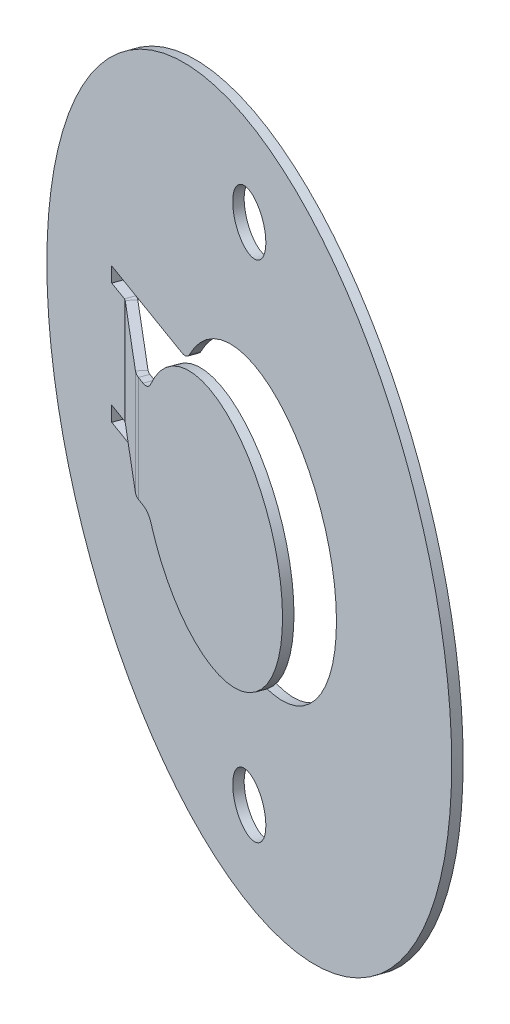
ISO-10303-21;
HEADER;
FILE_DESCRIPTION(('STEP AP214'),'2;1');
FILE_NAME('part.step','',(''),(''),'','','');
FILE_SCHEMA(('AUTOMOTIVE_DESIGN { 1 0 10303 214 1 1 1 1 }'));
ENDSEC;
DATA;
#1=APPLICATION_CONTEXT('core data for automotive mechanical design processes');
#2=APPLICATION_PROTOCOL_DEFINITION('international standard','automotive_design',2000,#1);
#3=PRODUCT_CONTEXT('',#1,'mechanical');
#4=PRODUCT('Part','Part','',(#3));
#5=PRODUCT_RELATED_PRODUCT_CATEGORY('part','',(#4));
#6=PRODUCT_DEFINITION_FORMATION('','',#4);
#7=PRODUCT_DEFINITION_CONTEXT('part definition',#1,'design');
#8=PRODUCT_DEFINITION('design','',#6,#7);
#9=PRODUCT_DEFINITION_SHAPE('','',#8);
#10=(LENGTH_UNIT() NAMED_UNIT(*) SI_UNIT(.MILLI.,.METRE.));
#11=(NAMED_UNIT(*) PLANE_ANGLE_UNIT() SI_UNIT($,.RADIAN.));
#12=(NAMED_UNIT(*) SI_UNIT($,.STERADIAN.) SOLID_ANGLE_UNIT());
#13=UNCERTAINTY_MEASURE_WITH_UNIT(LENGTH_MEASURE(1.E-05),#10,'distance_accuracy_value','');
#14=(GEOMETRIC_REPRESENTATION_CONTEXT(3) GLOBAL_UNCERTAINTY_ASSIGNED_CONTEXT((#13)) GLOBAL_UNIT_ASSIGNED_CONTEXT((#10,
#11,#12)) REPRESENTATION_CONTEXT('',''));
#15=CARTESIAN_POINT('',(0.,0.,0.));
#16=DIRECTION('',(0.,0.,1.));
#17=DIRECTION('',(1.,0.,0.));
#18=AXIS2_PLACEMENT_3D('',#15,#16,#17);
#19=CARTESIAN_POINT('',(-7.10565534939488,-1.8,-1.16279994263227));
#20=DIRECTION('',(0.,1.,0.));
#21=DIRECTION('',(-0.763796028634641,0.,-0.645457687723952));
#22=AXIS2_PLACEMENT_3D('',#19,#20,#21);
#23=PLANE('',#22);
#24=DIRECTION('',(0.763796028634641,0.,0.645457687723952));
#25=VECTOR('',#24,1.);
#26=CARTESIAN_POINT('',(-1.00787474173192,-1.8,3.59744917488349));
#27=LINE('',#26,#25);
#28=CARTESIAN_POINT('',(-4.05131456306547,-1.8,1.02554312122604));
#29=VERTEX_POINT('',#28);
#30=CARTESIAN_POINT('',(-6.27169304111087,-1.8,-0.850822170791939));
#31=VERTEX_POINT('',#30);
#32=EDGE_CURVE('E70',#29,#31,#27,.F.);
#33=ORIENTED_EDGE('',*,*,#32,.F.);
#34=DIRECTION('',(-0.645457687723952,0.,0.763796028634641));
#35=VECTOR('',#34,1.);
#36=CARTESIAN_POINT('',(-4.24495186938265,-1.8,1.25468192981643));
#37=LINE('',#36,#35);
#38=CARTESIAN_POINT('',(-4.24495186938265,-1.8,1.25468192981643));
#39=VERTEX_POINT('',#38);
#40=EDGE_CURVE('E194',#29,#39,#37,.T.);
#41=ORIENTED_EDGE('',*,*,#40,.T.);
#42=DIRECTION('',(-0.763796028634641,0.,-0.645457687723952));
#43=VECTOR('',#42,1.);
#44=CARTESIAN_POINT('',(-7.10565534939488,-1.8,-1.16279994263227));
#45=LINE('',#44,#43);
#46=CARTESIAN_POINT('',(-6.46533034742805,-1.8,-0.621683362201546));
#47=VERTEX_POINT('',#46);
#48=EDGE_CURVE('E49',#39,#47,#45,.T.);
#49=ORIENTED_EDGE('',*,*,#48,.T.);
#50=DIRECTION('',(-0.645457687723952,0.,0.763796028634641));
#51=VECTOR('',#50,1.);
#52=CARTESIAN_POINT('',(-6.46533034742805,-1.8,-0.621683362201546));
#53=LINE('',#52,#51);
#54=EDGE_CURVE('E195',#31,#47,#53,.T.);
#55=ORIENTED_EDGE('',*,*,#54,.F.);
#56=EDGE_LOOP('',(#33,#41,#49,#55));
#57=FACE_BOUND('',#56,.T.);
#58=ADVANCED_FACE('F45',(#57),#23,.F.);
#59=CARTESIAN_POINT('',(-3.87259407507794,1.75,1.56934866269738));
#60=DIRECTION('',(0.,-1.,0.));
#61=DIRECTION('',(0.763796028634641,0.,0.645457687723952));
#62=AXIS2_PLACEMENT_3D('',#59,#60,#61);
#63=PLANE('',#62);
#64=DIRECTION('',(0.763796028634641,0.,0.645457687723952));
#65=VECTOR('',#64,1.);
#66=CARTESIAN_POINT('',(-3.87259407507794,1.75,1.56934866269738));
#67=LINE('',#66,#65);
#68=CARTESIAN_POINT('',(-6.46533034742805,1.75,-0.621683362201546));
#69=VERTEX_POINT('',#68);
#70=CARTESIAN_POINT('',(-4.24495186938265,1.75,1.25468192981643));
#71=VERTEX_POINT('',#70);
#72=EDGE_CURVE('E213',#69,#71,#67,.T.);
#73=ORIENTED_EDGE('',*,*,#72,.T.);
#74=DIRECTION('',(0.645457687723952,0.,-0.763796028634641));
#75=VECTOR('',#74,1.);
#76=CARTESIAN_POINT('',(-4.24495186938265,1.75,1.25468192981643));
#77=LINE('',#76,#75);
#78=CARTESIAN_POINT('',(-4.05131456306547,1.75,1.02554312122604));
#79=VERTEX_POINT('',#78);
#80=EDGE_CURVE('E12',#71,#79,#77,.T.);
#81=ORIENTED_EDGE('',*,*,#80,.T.);
#82=DIRECTION('',(0.763796028634641,0.,0.645457687723952));
#83=VECTOR('',#82,1.);
#84=CARTESIAN_POINT('',(-1.00787474173192,1.75,3.59744917488349));
#85=LINE('',#84,#83);
#86=CARTESIAN_POINT('',(-6.27169304111087,1.75,-0.850822170791939));
#87=VERTEX_POINT('',#86);
#88=EDGE_CURVE('E219',#87,#79,#85,.T.);
#89=ORIENTED_EDGE('',*,*,#88,.F.);
#90=DIRECTION('',(0.645457687723952,0.,-0.763796028634641));
#91=VECTOR('',#90,1.);
#92=CARTESIAN_POINT('',(-6.46533034742805,1.75,-0.621683362201546));
#93=LINE('',#92,#91);
#94=EDGE_CURVE('E329',#69,#87,#93,.T.);
#95=ORIENTED_EDGE('',*,*,#94,.F.);
#96=EDGE_LOOP('',(#73,#81,#89,#95));
#97=FACE_BOUND('',#96,.T.);
#98=ADVANCED_FACE('F47',(#97),#63,.F.);
#99=CARTESIAN_POINT('',(-1.2015120480491,0.,3.82658798347388));
#100=DIRECTION('',(-0.645457687723952,0.,0.763796028634641));
#101=DIRECTION('',(0.763796028634641,0.,0.645457687723952));
#102=AXIS2_PLACEMENT_3D('',#99,#100,#101);
#103=PLANE('',#102);
#104=ORIENTED_EDGE('',*,*,#48,.F.);
#105=DIRECTION('',(0.,1.,0.));
#106=VECTOR('',#105,1.);
#107=CARTESIAN_POINT('',(-4.24495186938265,0.,1.25468192981643));
#108=LINE('',#107,#106);
#109=EDGE_CURVE('E186',#39,#71,#108,.T.);
#110=ORIENTED_EDGE('',*,*,#109,.T.);
#111=ORIENTED_EDGE('',*,*,#72,.F.);
#112=DIRECTION('',(0.,1.,0.));
#113=VECTOR('',#112,1.);
#114=CARTESIAN_POINT('',(-6.46533034742805,0.,-0.621683362201546));
#115=LINE('',#114,#113);
#116=EDGE_CURVE('E210',#47,#69,#115,.T.);
#117=ORIENTED_EDGE('',*,*,#116,.F.);
#118=EDGE_LOOP('',(#104,#110,#111,#117));
#119=FACE_BOUND('',#118,.T.);
#120=ADVANCED_FACE('F208',(#119),#103,.T.);
#121=CARTESIAN_POINT('',(-1.00787474173192,0.,3.59744917488349));
#122=DIRECTION('',(-0.645457687723952,0.,0.763796028634641));
#123=DIRECTION('',(0.763796028634641,0.,0.645457687723952));
#124=AXIS2_PLACEMENT_3D('',#121,#122,#123);
#125=PLANE('',#124);
#126=DIRECTION('',(0.,1.,0.));
#127=VECTOR('',#126,1.);
#128=CARTESIAN_POINT('',(-4.05131456306547,0.,1.02554312122604));
#129=LINE('',#128,#127);
#130=EDGE_CURVE('E54',#29,#79,#129,.T.);
#131=ORIENTED_EDGE('',*,*,#130,.F.);
#132=ORIENTED_EDGE('',*,*,#32,.T.);
#133=DIRECTION('',(0.,1.,0.));
#134=VECTOR('',#133,1.);
#135=CARTESIAN_POINT('',(-6.27169304111087,0.,-0.850822170791939));
#136=LINE('',#135,#134);
#137=EDGE_CURVE('E332',#31,#87,#136,.T.);
#138=ORIENTED_EDGE('',*,*,#137,.T.);
#139=ORIENTED_EDGE('',*,*,#88,.T.);
#140=EDGE_LOOP('',(#131,#132,#138,#139));
#141=FACE_BOUND('',#140,.T.);
#142=ADVANCED_FACE('F407',(#141),#125,.F.);
#143=CARTESIAN_POINT('',(-7.19785182118393,-1.8,-0.90139024621579));
#144=DIRECTION('',(-0.939692620785908,0.,-0.342020143325669));
#145=DIRECTION('',(0.,-1.,0.));
#146=AXIS2_PLACEMENT_3D('',#143,#144,#145);
#147=PLANE('',#146);
#148=DIRECTION('',(-0.342020143325669,0.,0.939692620785908));
#149=VECTOR('',#148,1.);
#150=CARTESIAN_POINT('',(-7.19785182118393,-2.3,-0.90139024621579));
#151=LINE('',#150,#149);
#152=CARTESIAN_POINT('',(-7.09524577818623,-2.3,-1.18329803245156));
#153=VERTEX_POINT('',#152);
#154=CARTESIAN_POINT('',(-7.19785182118393,-2.3,-0.90139024621579));
#155=VERTEX_POINT('',#154);
#156=EDGE_CURVE('E317',#153,#155,#151,.T.);
#157=ORIENTED_EDGE('',*,*,#156,.F.);
#158=DIRECTION('',(0.,1.,0.));
#159=VECTOR('',#158,1.);
#160=CARTESIAN_POINT('',(-7.09524577818623,0.,-1.18329803245156));
#161=LINE('',#160,#159);
#162=CARTESIAN_POINT('',(-7.09524577818623,-1.8,-1.18329803245156));
#163=VERTEX_POINT('',#162);
#164=EDGE_CURVE('E261',#163,#153,#161,.F.);
#165=ORIENTED_EDGE('',*,*,#164,.F.);
#166=DIRECTION('',(-0.342020143325669,0.,0.939692620785908));
#167=VECTOR('',#166,1.);
#168=CARTESIAN_POINT('',(-7.19785182118393,-1.8,-0.90139024621579));
#169=LINE('',#168,#167);
#170=CARTESIAN_POINT('',(-7.19785182118393,-1.8,-0.90139024621579));
#171=VERTEX_POINT('',#170);
#172=EDGE_CURVE('E322',#163,#171,#169,.T.);
#173=ORIENTED_EDGE('',*,*,#172,.T.);
#174=DIRECTION('',(0.,-1.,0.));
#175=VECTOR('',#174,1.);
#176=CARTESIAN_POINT('',(-7.19785182118393,-1.8,-0.90139024621579));
#177=LINE('',#176,#175);
#178=EDGE_CURVE('E319',#171,#155,#177,.T.);
#179=ORIENTED_EDGE('',*,*,#178,.T.);
#180=EDGE_LOOP('',(#157,#165,#173,#179));
#181=FACE_BOUND('',#180,.T.);
#182=ADVANCED_FACE('F409',(#181),#147,.F.);
#183=CARTESIAN_POINT('',(-7.19785182118393,-2.3,-0.90139024621579));
#184=DIRECTION('',(0.,-1.,0.));
#185=DIRECTION('',(0.939692620785908,0.,0.342020143325669));
#186=AXIS2_PLACEMENT_3D('',#183,#184,#185);
#187=PLANE('',#186);
#188=DIRECTION('',(-0.342020143325669,0.,0.939692620785908));
#189=VECTOR('',#188,1.);
#190=CARTESIAN_POINT('',(-3.45079276047736,-2.3,0.462427717918881));
#191=LINE('',#190,#189);
#192=CARTESIAN_POINT('',(-3.34818671747965,-2.3,0.180519931683108));
#193=VERTEX_POINT('',#192);
#194=CARTESIAN_POINT('',(-3.45079276047736,-2.3,0.462427717918881));
#195=VERTEX_POINT('',#194);
#196=EDGE_CURVE('E312',#193,#195,#191,.T.);
#197=ORIENTED_EDGE('',*,*,#196,.F.);
#198=DIRECTION('',(0.939692620785908,0.,0.342020143325669));
#199=VECTOR('',#198,1.);
#200=CARTESIAN_POINT('',(0.168578180488842,-2.3,1.46051767545586));
#201=LINE('',#200,#199);
#202=EDGE_CURVE('E258',#153,#193,#201,.T.);
#203=ORIENTED_EDGE('',*,*,#202,.F.);
#204=ORIENTED_EDGE('',*,*,#156,.T.);
#205=DIRECTION('',(0.939692620785908,0.,0.342020143325669));
#206=VECTOR('',#205,1.);
#207=CARTESIAN_POINT('',(-7.19785182118393,-2.3,-0.90139024621579));
#208=LINE('',#207,#206);
#209=EDGE_CURVE('E314',#155,#195,#208,.T.);
#210=ORIENTED_EDGE('',*,*,#209,.T.);
#211=EDGE_LOOP('',(#197,#203,#204,#210));
#212=FACE_BOUND('',#211,.T.);
#213=ADVANCED_FACE('F414',(#212),#187,.F.);
#214=CARTESIAN_POINT('',(-3.45079276047736,-2.8,0.462427717918881));
#215=DIRECTION('',(-0.342020143325669,0.,0.939692620785908));
#216=DIRECTION('',(0.939692620785908,0.,0.342020143325669));
#217=AXIS2_PLACEMENT_3D('',#214,#215,#216);
#218=CYLINDRICAL_SURFACE('',#217,0.5);
#219=DIRECTION('',(-0.342020143325669,0.,0.939692620785908));
#220=VECTOR('',#219,1.);
#221=CARTESIAN_POINT('',(-3.06152856584907,-2.52,0.604108298029183));
#222=LINE('',#221,#220);
#223=CARTESIAN_POINT('',(-2.95892252285137,-2.52,0.322200511793411));
#224=VERTEX_POINT('',#223);
#225=CARTESIAN_POINT('',(-3.06152856584907,-2.52,0.604108298029183));
#226=VERTEX_POINT('',#225);
#227=EDGE_CURVE('E307',#224,#226,#222,.T.);
#228=ORIENTED_EDGE('',*,*,#227,.F.);
#229=CARTESIAN_POINT('',(-3.34818671747965,-2.8,0.180519931683108));
#230=DIRECTION('',(0.342020143325669,0.,-0.939692620785908));
#231=DIRECTION('',(-0.939692620785908,0.,-0.342020143325669));
#232=AXIS2_PLACEMENT_3D('',#229,#230,#231);
#233=CIRCLE('',#232,0.5);
#234=EDGE_CURVE('E255',#193,#224,#233,.T.);
#235=ORIENTED_EDGE('',*,*,#234,.F.);
#236=ORIENTED_EDGE('',*,*,#196,.T.);
#237=CARTESIAN_POINT('',(-3.45079276047736,-2.8,0.462427717918881));
#238=DIRECTION('',(0.342020143325669,0.,-0.939692620785908));
#239=DIRECTION('',(0.939692620785908,0.,0.342020143325669));
#240=AXIS2_PLACEMENT_3D('',#237,#238,#239);
#241=CIRCLE('',#240,0.5);
#242=EDGE_CURVE('E309',#195,#226,#241,.T.);
#243=ORIENTED_EDGE('',*,*,#242,.T.);
#244=EDGE_LOOP('',(#228,#235,#236,#243));
#245=FACE_BOUND('',#244,.T.);
#246=ADVANCED_FACE('F467',(#245),#218,.T.);
#247=CARTESIAN_POINT('',(0.441849185805504,0.,1.8792335190219));
#248=DIRECTION('',(-0.342020143325669,0.,0.939692620785908));
#249=DIRECTION('',(0.939692620785908,0.,0.342020143325669));
#250=AXIS2_PLACEMENT_3D('',#247,#248,#249);
#251=CYLINDRICAL_SURFACE('',#250,4.5);
#252=DIRECTION('',(-0.342020143325669,0.,0.939692620785908));
#253=VECTOR('',#252,1.);
#254=CARTESIAN_POINT('',(-3.08974209726213,2.475,0.593839412391294));
#255=LINE('',#254,#253);
#256=CARTESIAN_POINT('',(-2.98713605426443,2.475,0.311931626155521));
#257=VERTEX_POINT('',#256);
#258=CARTESIAN_POINT('',(-3.08974209726213,2.475,0.593839412391294));
#259=VERTEX_POINT('',#258);
#260=EDGE_CURVE('E302',#257,#259,#255,.T.);
#261=ORIENTED_EDGE('',*,*,#260,.F.);
#262=CARTESIAN_POINT('',(0.544455228803205,0.,1.59732573278613));
#263=DIRECTION('',(-0.342020143325669,0.,0.939692620785908));
#264=DIRECTION('',(0.939692620785908,0.,0.342020143325669));
#265=AXIS2_PLACEMENT_3D('',#262,#263,#264);
#266=CIRCLE('',#265,4.5);
#267=EDGE_CURVE('E252',#224,#257,#266,.T.);
#268=ORIENTED_EDGE('',*,*,#267,.F.);
#269=ORIENTED_EDGE('',*,*,#227,.T.);
#270=CARTESIAN_POINT('',(0.441849185805504,0.,1.8792335190219));
#271=DIRECTION('',(-0.342020143325669,0.,0.939692620785908));
#272=DIRECTION('',(-0.939692620785908,0.,-0.342020143325669));
#273=AXIS2_PLACEMENT_3D('',#270,#271,#272);
#274=CIRCLE('',#273,4.5);
#275=EDGE_CURVE('E304',#226,#259,#274,.T.);
#276=ORIENTED_EDGE('',*,*,#275,.T.);
#277=EDGE_LOOP('',(#261,#268,#269,#276));
#278=FACE_BOUND('',#277,.T.);
#279=ADVANCED_FACE('F463',(#278),#251,.F.);
#280=CARTESIAN_POINT('',(-3.48214112871409,2.75,0.451017844987893));
#281=DIRECTION('',(-0.342020143325669,0.,0.939692620785908));
#282=DIRECTION('',(0.939692620785908,0.,0.342020143325669));
#283=AXIS2_PLACEMENT_3D('',#280,#281,#282);
#284=CYLINDRICAL_SURFACE('',#283,0.5);
#285=DIRECTION('',(-0.342020143325669,0.,0.939692620785908));
#286=VECTOR('',#285,1.);
#287=CARTESIAN_POINT('',(-3.48214112871409,2.25,0.451017844987893));
#288=LINE('',#287,#286);
#289=CARTESIAN_POINT('',(-3.37953508571639,2.25,0.16911005875212));
#290=VERTEX_POINT('',#289);
#291=CARTESIAN_POINT('',(-3.48214112871409,2.25,0.451017844987893));
#292=VERTEX_POINT('',#291);
#293=EDGE_CURVE('E297',#290,#292,#288,.T.);
#294=ORIENTED_EDGE('',*,*,#293,.F.);
#295=CARTESIAN_POINT('',(-3.37953508571639,2.75,0.16911005875212));
#296=DIRECTION('',(0.342020143325669,0.,-0.939692620785908));
#297=DIRECTION('',(-0.939692620785908,0.,-0.342020143325669));
#298=AXIS2_PLACEMENT_3D('',#295,#296,#297);
#299=CIRCLE('',#298,0.5);
#300=EDGE_CURVE('E249',#257,#290,#299,.T.);
#301=ORIENTED_EDGE('',*,*,#300,.F.);
#302=ORIENTED_EDGE('',*,*,#260,.T.);
#303=CARTESIAN_POINT('',(-3.48214112871409,2.75,0.451017844987893));
#304=DIRECTION('',(0.342020143325669,0.,-0.939692620785908));
#305=DIRECTION('',(0.939692620785908,0.,0.342020143325669));
#306=AXIS2_PLACEMENT_3D('',#303,#304,#305);
#307=CIRCLE('',#306,0.5);
#308=EDGE_CURVE('E299',#259,#292,#307,.T.);
#309=ORIENTED_EDGE('',*,*,#308,.T.);
#310=EDGE_LOOP('',(#294,#301,#302,#309));
#311=FACE_BOUND('',#310,.T.);
#312=ADVANCED_FACE('F459',(#311),#284,.T.);
#313=CARTESIAN_POINT('',(-7.19785182118393,2.25,-0.90139024621579));
#314=DIRECTION('',(0.,1.,0.));
#315=DIRECTION('',(-0.939692620785908,0.,-0.342020143325669));
#316=AXIS2_PLACEMENT_3D('',#313,#314,#315);
#317=PLANE('',#316);
#318=DIRECTION('',(-0.342020143325669,0.,0.939692620785908));
#319=VECTOR('',#318,1.);
#320=CARTESIAN_POINT('',(-7.19785182118393,2.25,-0.90139024621579));
#321=LINE('',#320,#319);
#322=CARTESIAN_POINT('',(-7.09524577818623,2.25,-1.18329803245156));
#323=VERTEX_POINT('',#322);
#324=CARTESIAN_POINT('',(-7.19785182118393,2.25,-0.90139024621579));
#325=VERTEX_POINT('',#324);
#326=EDGE_CURVE('E292',#323,#325,#321,.T.);
#327=ORIENTED_EDGE('',*,*,#326,.F.);
#328=DIRECTION('',(0.939692620785908,0.,0.342020143325669));
#329=VECTOR('',#328,1.);
#330=CARTESIAN_POINT('',(0.168578180488842,2.25,1.46051767545586));
#331=LINE('',#330,#329);
#332=EDGE_CURVE('E246',#290,#323,#331,.F.);
#333=ORIENTED_EDGE('',*,*,#332,.F.);
#334=ORIENTED_EDGE('',*,*,#293,.T.);
#335=DIRECTION('',(-0.939692620785908,0.,-0.342020143325669));
#336=VECTOR('',#335,1.);
#337=CARTESIAN_POINT('',(-7.19785182118393,2.25,-0.90139024621579));
#338=LINE('',#337,#336);
#339=EDGE_CURVE('E294',#292,#325,#338,.T.);
#340=ORIENTED_EDGE('',*,*,#339,.T.);
#341=EDGE_LOOP('',(#327,#333,#334,#340));
#342=FACE_BOUND('',#341,.T.);
#343=ADVANCED_FACE('F455',(#342),#317,.F.);
#344=CARTESIAN_POINT('',(-7.19785182118393,1.75,-0.90139024621579));
#345=DIRECTION('',(-0.939692620785908,0.,-0.342020143325669));
#346=DIRECTION('',(0.,-1.,0.));
#347=AXIS2_PLACEMENT_3D('',#344,#345,#346);
#348=PLANE('',#347);
#349=DIRECTION('',(0.,1.,0.));
#350=VECTOR('',#349,1.);
#351=CARTESIAN_POINT('',(-7.09524577818623,0.,-1.18329803245156));
#352=LINE('',#351,#350);
#353=CARTESIAN_POINT('',(-7.09524577818623,1.75,-1.18329803245156));
#354=VERTEX_POINT('',#353);
#355=EDGE_CURVE('E243',#323,#354,#352,.F.);
#356=ORIENTED_EDGE('',*,*,#355,.F.);
#357=ORIENTED_EDGE('',*,*,#326,.T.);
#358=DIRECTION('',(0.,-1.,0.));
#359=VECTOR('',#358,1.);
#360=CARTESIAN_POINT('',(-7.19785182118393,1.75,-0.90139024621579));
#361=LINE('',#360,#359);
#362=CARTESIAN_POINT('',(-7.19785182118393,1.75,-0.90139024621579));
#363=VERTEX_POINT('',#362);
#364=EDGE_CURVE('E289',#325,#363,#361,.T.);
#365=ORIENTED_EDGE('',*,*,#364,.T.);
#366=DIRECTION('',(-0.342020143325669,0.,0.939692620785908));
#367=VECTOR('',#366,1.);
#368=CARTESIAN_POINT('',(-7.19785182118393,1.75,-0.90139024621579));
#369=LINE('',#368,#367);
#370=EDGE_CURVE('E266',#354,#363,#369,.T.);
#371=ORIENTED_EDGE('',*,*,#370,.F.);
#372=EDGE_LOOP('',(#356,#357,#365,#371));
#373=FACE_BOUND('',#372,.T.);
#374=ADVANCED_FACE('F451',(#373),#348,.F.);
#375=CARTESIAN_POINT('',(0.0659721374911431,-8.475,1.74242546169164));
#376=DIRECTION('',(-0.342020143325669,0.,0.939692620785908));
#377=DIRECTION('',(0.939692620785908,0.,0.342020143325669));
#378=AXIS2_PLACEMENT_3D('',#375,#376,#377);
#379=CYLINDRICAL_SURFACE('',#378,0.93);
#380=CARTESIAN_POINT('',(0.0659721374911431,-8.475,1.74242546169164));
#381=DIRECTION('',(-0.342020143325669,0.,0.939692620785908));
#382=DIRECTION('',(0.939692620785908,0.,0.342020143325669));
#383=AXIS2_PLACEMENT_3D('',#380,#381,#382);
#384=CIRCLE('',#383,0.93);
#385=CARTESIAN_POINT('',(0.939886274822038,-8.475,2.06050419498451));
#386=VERTEX_POINT('',#385);
#387=EDGE_CURVE('E286',#386,#386,#384,.T.);
#388=ORIENTED_EDGE('',*,*,#387,.T.);
#389=EDGE_LOOP('',(#388));
#390=FACE_BOUND('',#389,.T.);
#391=CARTESIAN_POINT('',(0.168578180488844,-8.475,1.46051767545586));
#392=DIRECTION('',(-0.342020143325669,0.,0.939692620785908));
#393=DIRECTION('',(0.939692620785908,0.,0.342020143325669));
#394=AXIS2_PLACEMENT_3D('',#391,#392,#393);
#395=CIRCLE('',#394,0.93);
#396=CARTESIAN_POINT('',(1.04249231781974,-8.475,1.77859640874874));
#397=VERTEX_POINT('',#396);
#398=EDGE_CURVE('E229',#397,#397,#395,.T.);
#399=ORIENTED_EDGE('',*,*,#398,.F.);
#400=EDGE_LOOP('',(#399));
#401=FACE_BOUND('',#400,.T.);
#402=ADVANCED_FACE('F447',(#390,#401),#379,.F.);
#403=CARTESIAN_POINT('',(0.0659721374911409,0.,1.74242546169163));
#404=DIRECTION('',(-0.342020143325669,0.,0.939692620785908));
#405=DIRECTION('',(0.939692620785908,0.,0.342020143325669));
#406=AXIS2_PLACEMENT_3D('',#403,#404,#405);
#407=CYLINDRICAL_SURFACE('',#406,11.375);
#408=CARTESIAN_POINT('',(0.0659721374911409,0.,1.74242546169163));
#409=DIRECTION('',(-0.342020143325669,0.,0.939692620785908));
#410=DIRECTION('',(0.939692620785908,0.,0.342020143325669));
#411=AXIS2_PLACEMENT_3D('',#408,#409,#410);
#412=CIRCLE('',#411,11.375);
#413=CARTESIAN_POINT('',(10.7549756989308,0.,5.63290459202112));
#414=VERTEX_POINT('',#413);
#415=EDGE_CURVE('E277',#414,#414,#412,.T.);
#416=ORIENTED_EDGE('',*,*,#415,.F.);
#417=EDGE_LOOP('',(#416));
#418=FACE_BOUND('',#417,.T.);
#419=CARTESIAN_POINT('',(0.168578180488842,0.,1.46051767545586));
#420=DIRECTION('',(-0.342020143325669,0.,0.939692620785908));
#421=DIRECTION('',(0.939692620785908,0.,0.342020143325669));
#422=AXIS2_PLACEMENT_3D('',#419,#420,#421);
#423=CIRCLE('',#422,11.375);
#424=CARTESIAN_POINT('',(10.8575817419285,0.,5.35099680578535));
#425=VERTEX_POINT('',#424);
#426=EDGE_CURVE('E283',#425,#425,#423,.T.);
#427=ORIENTED_EDGE('',*,*,#426,.T.);
#428=EDGE_LOOP('',(#427));
#429=FACE_BOUND('',#428,.T.);
#430=ADVANCED_FACE('F443',(#418,#429),#407,.T.);
#431=CARTESIAN_POINT('',(0.0659721374911382,8.475,1.74242546169163));
#432=DIRECTION('',(-0.342020143325669,0.,0.939692620785908));
#433=DIRECTION('',(0.939692620785908,0.,0.342020143325669));
#434=AXIS2_PLACEMENT_3D('',#431,#432,#433);
#435=CYLINDRICAL_SURFACE('',#434,0.93);
#436=CARTESIAN_POINT('',(0.0659721374911382,8.475,1.74242546169163));
#437=DIRECTION('',(-0.342020143325669,0.,0.939692620785908));
#438=DIRECTION('',(0.939692620785908,0.,0.342020143325669));
#439=AXIS2_PLACEMENT_3D('',#436,#437,#438);
#440=CIRCLE('',#439,0.93);
#441=CARTESIAN_POINT('',(0.939886274822033,8.475,2.06050419498451));
#442=VERTEX_POINT('',#441);
#443=EDGE_CURVE('E280',#442,#442,#440,.T.);
#444=ORIENTED_EDGE('',*,*,#443,.T.);
#445=EDGE_LOOP('',(#444));
#446=FACE_BOUND('',#445,.T.);
#447=CARTESIAN_POINT('',(0.168578180488839,8.475,1.46051767545586));
#448=DIRECTION('',(-0.342020143325669,0.,0.939692620785908));
#449=DIRECTION('',(0.939692620785908,0.,0.342020143325669));
#450=AXIS2_PLACEMENT_3D('',#447,#448,#449);
#451=CIRCLE('',#450,0.93);
#452=CARTESIAN_POINT('',(1.04249231781973,8.475,1.77859640874873));
#453=VERTEX_POINT('',#452);
#454=EDGE_CURVE('E237',#453,#453,#451,.T.);
#455=ORIENTED_EDGE('',*,*,#454,.F.);
#456=EDGE_LOOP('',(#455));
#457=FACE_BOUND('',#456,.T.);
#458=ADVANCED_FACE('F439',(#446,#457),#435,.F.);
#459=CARTESIAN_POINT('',(0.0659721374911409,0.,1.74242546169163));
#460=DIRECTION('',(-0.342020143325669,0.,0.939692620785908));
#461=DIRECTION('',(0.939692620785908,0.,0.342020143325669));
#462=AXIS2_PLACEMENT_3D('',#459,#460,#461);
#463=PLANE('',#462);
#464=ORIENTED_EDGE('',*,*,#443,.F.);
#465=EDGE_LOOP('',(#464));
#466=FACE_BOUND('',#465,.T.);
#467=ORIENTED_EDGE('',*,*,#415,.T.);
#468=EDGE_LOOP('',(#467));
#469=FACE_BOUND('',#468,.T.);
#470=ORIENTED_EDGE('',*,*,#387,.F.);
#471=EDGE_LOOP('',(#470));
#472=FACE_BOUND('',#471,.T.);
#473=DIRECTION('',(-0.939692620785908,0.,-0.342020143325669));
#474=VECTOR('',#473,1.);
#475=CARTESIAN_POINT('',(-7.19785182118393,-1.8,-0.90139024621579));
#476=LINE('',#475,#474);
#477=CARTESIAN_POINT('',(-6.52601785630771,-1.8,-0.656862680631799));
#478=VERTEX_POINT('',#477);
#479=EDGE_CURVE('E221',#478,#171,#476,.T.);
#480=ORIENTED_EDGE('',*,*,#479,.F.);
#481=DIRECTION('',(0.,1.,0.));
#482=VECTOR('',#481,1.);
#483=CARTESIAN_POINT('',(-6.52601785630771,0.,-0.656862680631799));
#484=LINE('',#483,#482);
#485=CARTESIAN_POINT('',(-6.52601785630771,1.75,-0.656862680631799));
#486=VERTEX_POINT('',#485);
#487=EDGE_CURVE('E274',#478,#486,#484,.T.);
#488=ORIENTED_EDGE('',*,*,#487,.T.);
#489=DIRECTION('',(0.939692620785908,0.,0.342020143325669));
#490=VECTOR('',#489,1.);
#491=CARTESIAN_POINT('',(-3.22024038026668,1.75,0.546341921754793));
#492=LINE('',#491,#490);
#493=EDGE_CURVE('E271',#363,#486,#492,.T.);
#494=ORIENTED_EDGE('',*,*,#493,.F.);
#495=ORIENTED_EDGE('',*,*,#364,.F.);
#496=ORIENTED_EDGE('',*,*,#339,.F.);
#497=ORIENTED_EDGE('',*,*,#308,.F.);
#498=ORIENTED_EDGE('',*,*,#275,.F.);
#499=ORIENTED_EDGE('',*,*,#242,.F.);
#500=ORIENTED_EDGE('',*,*,#209,.F.);
#501=ORIENTED_EDGE('',*,*,#178,.F.);
#502=EDGE_LOOP('',(#480,#488,#494,#495,#496,#497,#498,#499,#500,#501));
#503=FACE_BOUND('',#502,.T.);
#504=ADVANCED_FACE('F435',(#466,#469,#472,#503),#463,.T.);
#505=CARTESIAN_POINT('',(-3.22024038026668,1.75,0.546341921754793));
#506=DIRECTION('',(0.,-1.,0.));
#507=DIRECTION('',(0.939692620785908,0.,0.342020143325669));
#508=AXIS2_PLACEMENT_3D('',#505,#506,#507);
#509=PLANE('',#508);
#510=ORIENTED_EDGE('',*,*,#493,.T.);
#511=DIRECTION('',(0.342020143325669,0.,-0.939692620785908));
#512=VECTOR('',#511,1.);
#513=CARTESIAN_POINT('',(-6.52601785630771,1.75,-0.656862680631799));
#514=LINE('',#513,#512);
#515=CARTESIAN_POINT('',(-6.42341181331001,1.75,-0.938770466867572));
#516=VERTEX_POINT('',#515);
#517=EDGE_CURVE('E268',#486,#516,#514,.T.);
#518=ORIENTED_EDGE('',*,*,#517,.T.);
#519=DIRECTION('',(0.939692620785908,0.,0.342020143325669));
#520=VECTOR('',#519,1.);
#521=CARTESIAN_POINT('',(0.168578180488842,1.75,1.46051767545586));
#522=LINE('',#521,#520);
#523=EDGE_CURVE('E240',#354,#516,#522,.T.);
#524=ORIENTED_EDGE('',*,*,#523,.F.);
#525=ORIENTED_EDGE('',*,*,#370,.T.);
#526=EDGE_LOOP('',(#510,#518,#524,#525));
#527=FACE_BOUND('',#526,.T.);
#528=ADVANCED_FACE('F431',(#527),#509,.F.);
#529=CARTESIAN_POINT('',(0.168578180488842,0.,1.46051767545586));
#530=DIRECTION('',(-0.342020143325669,0.,0.939692620785908));
#531=DIRECTION('',(0.939692620785908,0.,0.342020143325669));
#532=AXIS2_PLACEMENT_3D('',#529,#530,#531);
#533=PLANE('',#532);
#534=DIRECTION('',(0.,1.,0.));
#535=VECTOR('',#534,1.);
#536=CARTESIAN_POINT('',(-6.42341181331001,0.,-0.938770466867572));
#537=LINE('',#536,#535);
#538=CARTESIAN_POINT('',(-6.42341181331001,-1.8,-0.938770466867572));
#539=VERTEX_POINT('',#538);
#540=EDGE_CURVE('E324',#539,#516,#537,.T.);
#541=ORIENTED_EDGE('',*,*,#540,.F.);
#542=DIRECTION('',(0.939692620785908,0.,0.342020143325669));
#543=VECTOR('',#542,1.);
#544=CARTESIAN_POINT('',(0.168578180488842,-1.8,1.46051767545586));
#545=LINE('',#544,#543);
#546=EDGE_CURVE('E264',#539,#163,#545,.F.);
#547=ORIENTED_EDGE('',*,*,#546,.T.);
#548=ORIENTED_EDGE('',*,*,#164,.T.);
#549=ORIENTED_EDGE('',*,*,#202,.T.);
#550=ORIENTED_EDGE('',*,*,#234,.T.);
#551=ORIENTED_EDGE('',*,*,#267,.T.);
#552=ORIENTED_EDGE('',*,*,#300,.T.);
#553=ORIENTED_EDGE('',*,*,#332,.T.);
#554=ORIENTED_EDGE('',*,*,#355,.T.);
#555=ORIENTED_EDGE('',*,*,#523,.T.);
#556=EDGE_LOOP('',(#541,#547,#548,#549,#550,#551,#552,#553,#554,#555));
#557=FACE_BOUND('',#556,.T.);
#558=ORIENTED_EDGE('',*,*,#454,.T.);
#559=EDGE_LOOP('',(#558));
#560=FACE_BOUND('',#559,.T.);
#561=ORIENTED_EDGE('',*,*,#426,.F.);
#562=EDGE_LOOP('',(#561));
#563=FACE_BOUND('',#562,.T.);
#564=ORIENTED_EDGE('',*,*,#398,.T.);
#565=EDGE_LOOP('',(#564));
#566=FACE_BOUND('',#565,.T.);
#567=ADVANCED_FACE('F428',(#557,#560,#563,#566),#533,.F.);
#568=CARTESIAN_POINT('',(-7.19785182118393,-1.8,-0.90139024621579));
#569=DIRECTION('',(0.,1.,0.));
#570=DIRECTION('',(-0.939692620785908,0.,-0.342020143325669));
#571=AXIS2_PLACEMENT_3D('',#568,#569,#570);
#572=PLANE('',#571);
#573=ORIENTED_EDGE('',*,*,#546,.F.);
#574=DIRECTION('',(-0.342020143325669,0.,0.939692620785908));
#575=VECTOR('',#574,1.);
#576=CARTESIAN_POINT('',(-6.52601785630771,-1.8,-0.656862680631799));
#577=LINE('',#576,#575);
#578=EDGE_CURVE('E222',#539,#478,#577,.T.);
#579=ORIENTED_EDGE('',*,*,#578,.T.);
#580=ORIENTED_EDGE('',*,*,#479,.T.);
#581=ORIENTED_EDGE('',*,*,#172,.F.);
#582=EDGE_LOOP('',(#573,#579,#580,#581));
#583=FACE_BOUND('',#582,.T.);
#584=ADVANCED_FACE('F425',(#583),#572,.F.);
#585=CARTESIAN_POINT('',(-6.59442188497284,-1.8,-0.468924156474618));
#586=DIRECTION('',(0.,1.,0.));
#587=DIRECTION('',(-0.342020143325669,0.,0.939692620785908));
#588=AXIS2_PLACEMENT_3D('',#585,#586,#587);
#589=PLANE('',#588);
#590=ORIENTED_EDGE('',*,*,#578,.F.);
#591=CARTESIAN_POINT('',(-6.59442188497284,-1.8,-0.468924156474618));
#592=DIRECTION('',(0.,1.,0.));
#593=DIRECTION('',(-0.342020143325669,0.,0.939692620785908));
#594=AXIS2_PLACEMENT_3D('',#591,#592,#593);
#595=CIRCLE('',#594,0.5);
#596=EDGE_CURVE('E340',#539,#31,#595,.F.);
#597=ORIENTED_EDGE('',*,*,#596,.T.);
#598=ORIENTED_EDGE('',*,*,#54,.T.);
#599=CARTESIAN_POINT('',(-6.59442188497284,-1.8,-0.468924156474618));
#600=DIRECTION('',(0.,-1.,0.));
#601=DIRECTION('',(-0.342020143325669,0.,0.939692620785908));
#602=AXIS2_PLACEMENT_3D('',#599,#600,#601);
#603=CIRCLE('',#602,0.2);
#604=EDGE_CURVE('E338',#478,#47,#603,.T.);
#605=ORIENTED_EDGE('',*,*,#604,.F.);
#606=EDGE_LOOP('',(#590,#597,#598,#605));
#607=FACE_BOUND('',#606,.T.);
#608=ADVANCED_FACE('F337',(#607),#589,.F.);
#609=CARTESIAN_POINT('',(-6.59442188497284,1.75,-0.468924156474618));
#610=DIRECTION('',(0.,-1.,0.));
#611=DIRECTION('',(0.342020143325669,0.,-0.939692620785908));
#612=AXIS2_PLACEMENT_3D('',#609,#610,#611);
#613=PLANE('',#612);
#614=CARTESIAN_POINT('',(-6.59442188497284,1.75,-0.468924156474618));
#615=DIRECTION('',(0.,1.,0.));
#616=DIRECTION('',(-0.342020143325669,0.,0.939692620785908));
#617=AXIS2_PLACEMENT_3D('',#614,#615,#616);
#618=CIRCLE('',#617,0.5);
#619=EDGE_CURVE('E232',#87,#516,#618,.T.);
#620=ORIENTED_EDGE('',*,*,#619,.T.);
#621=ORIENTED_EDGE('',*,*,#517,.F.);
#622=CARTESIAN_POINT('',(-6.59442188497284,1.75,-0.468924156474618));
#623=DIRECTION('',(0.,1.,0.));
#624=DIRECTION('',(0.342020143325669,0.,-0.939692620785908));
#625=AXIS2_PLACEMENT_3D('',#622,#623,#624);
#626=CIRCLE('',#625,0.2);
#627=EDGE_CURVE('E327',#69,#486,#626,.T.);
#628=ORIENTED_EDGE('',*,*,#627,.F.);
#629=ORIENTED_EDGE('',*,*,#94,.T.);
#630=EDGE_LOOP('',(#620,#621,#628,#629));
#631=FACE_BOUND('',#630,.T.);
#632=ADVANCED_FACE('F475',(#631),#613,.F.);
#633=CARTESIAN_POINT('',(-6.59442188497284,-3.58978979341928,-0.468924156474618));
#634=DIRECTION('',(0.,1.,0.));
#635=DIRECTION('',(-0.342020143325669,0.,0.939692620785908));
#636=AXIS2_PLACEMENT_3D('',#633,#634,#635);
#637=CYLINDRICAL_SURFACE('',#636,0.2);
#638=ORIENTED_EDGE('',*,*,#116,.T.);
#639=ORIENTED_EDGE('',*,*,#627,.T.);
#640=ORIENTED_EDGE('',*,*,#487,.F.);
#641=ORIENTED_EDGE('',*,*,#604,.T.);
#642=EDGE_LOOP('',(#638,#639,#640,#641));
#643=FACE_BOUND('',#642,.T.);
#644=ADVANCED_FACE('F343',(#643),#637,.F.);
#645=CARTESIAN_POINT('',(-6.59442188497284,-3.58978979341928,-0.468924156474618));
#646=DIRECTION('',(0.,1.,0.));
#647=DIRECTION('',(-0.342020143325669,0.,0.939692620785908));
#648=AXIS2_PLACEMENT_3D('',#645,#646,#647);
#649=CYLINDRICAL_SURFACE('',#648,0.5);
#650=ORIENTED_EDGE('',*,*,#137,.F.);
#651=ORIENTED_EDGE('',*,*,#596,.F.);
#652=ORIENTED_EDGE('',*,*,#540,.T.);
#653=ORIENTED_EDGE('',*,*,#619,.F.);
#654=EDGE_LOOP('',(#650,#651,#652,#653));
#655=FACE_BOUND('',#654,.T.);
#656=ADVANCED_FACE('F481',(#655),#649,.T.);
#657=CARTESIAN_POINT('',(-3.76023735802623,2.25,1.48442998967637));
#658=DIRECTION('',(-0.345298198998535,0.,0.938493022759556));
#659=DIRECTION('',(0.938493022759556,0.,0.345298198998535));
#660=AXIS2_PLACEMENT_3D('',#657,#658,#659);
#661=CYLINDRICAL_SURFACE('',#660,0.5);
#662=DIRECTION('',(-0.345298198998535,0.,0.938493022759556));
#663=VECTOR('',#662,1.);
#664=CARTESIAN_POINT('',(-3.35385795853412,2.,1.63394849578325));
#665=LINE('',#664,#663);
#666=CARTESIAN_POINT('',(-3.25026849883456,2.,1.35240058895538));
#667=VERTEX_POINT('',#666);
#668=CARTESIAN_POINT('',(-3.35385795853412,2.,1.63394849578325));
#669=VERTEX_POINT('',#668);
#670=EDGE_CURVE('E388',#667,#669,#665,.T.);
#671=ORIENTED_EDGE('',*,*,#670,.F.);
#672=CARTESIAN_POINT('',(-3.65664789832667,2.25,1.20288208284851));
#673=DIRECTION('',(-0.345298198998535,0.,0.938493022759556));
#674=DIRECTION('',(0.938493022759556,0.,0.345298198998535));
#675=AXIS2_PLACEMENT_3D('',#672,#673,#674);
#676=CIRCLE('',#675,0.5);
#677=CARTESIAN_POINT('',(-3.65664789832667,1.75,1.20288208284851));
#678=VERTEX_POINT('',#677);
#679=EDGE_CURVE('E366',#678,#667,#676,.T.);
#680=ORIENTED_EDGE('',*,*,#679,.F.);
#681=DIRECTION('',(-0.345298198998535,0.,0.938493022759556));
#682=VECTOR('',#681,1.);
#683=CARTESIAN_POINT('',(-3.76023735802623,1.75,1.48442998967637));
#684=LINE('',#683,#682);
#685=CARTESIAN_POINT('',(-3.76023735802623,1.75,1.48442998967637));
#686=VERTEX_POINT('',#685);
#687=EDGE_CURVE('E393',#678,#686,#684,.T.);
#688=ORIENTED_EDGE('',*,*,#687,.T.);
#689=CARTESIAN_POINT('',(-3.76023735802623,2.25,1.48442998967637));
#690=DIRECTION('',(-0.345298198998535,0.,0.938493022759556));
#691=DIRECTION('',(0.938493022759556,0.,0.345298198998535));
#692=AXIS2_PLACEMENT_3D('',#689,#690,#691);
#693=CIRCLE('',#692,0.5);
#694=EDGE_CURVE('E390',#686,#669,#693,.T.);
#695=ORIENTED_EDGE('',*,*,#694,.T.);
#696=EDGE_LOOP('',(#671,#680,#688,#695));
#697=FACE_BOUND('',#696,.T.);
#698=ADVANCED_FACE('F484',(#697),#661,.F.);
#699=CARTESIAN_POINT('',(-0.102822762597229,0.,2.83009654463823));
#700=DIRECTION('',(-0.345298198998535,0.,0.938493022759556));
#701=DIRECTION('',(0.938493022759556,0.,0.345298198998535));
#702=AXIS2_PLACEMENT_3D('',#699,#700,#701);
#703=CYLINDRICAL_SURFACE('',#702,4.);
#704=DIRECTION('',(-0.345298198998535,0.,0.938493022759556));
#705=VECTOR('',#704,1.);
#706=CARTESIAN_POINT('',(-3.32941676733462,-2.04444444444444,1.64294110318458));
#707=LINE('',#706,#705);
#708=CARTESIAN_POINT('',(-3.22582730763505,-2.04444444444444,1.36139319635671));
#709=VERTEX_POINT('',#708);
#710=CARTESIAN_POINT('',(-3.32941676733462,-2.04444444444444,1.64294110318458));
#711=VERTEX_POINT('',#710);
#712=EDGE_CURVE('E383',#709,#711,#707,.T.);
#713=ORIENTED_EDGE('',*,*,#712,.F.);
#714=CARTESIAN_POINT('',(0.000766697102331615,0.,2.54854863781036));
#715=DIRECTION('',(0.345298198998535,0.,-0.938493022759556));
#716=DIRECTION('',(-0.938493022759556,0.,-0.345298198998535));
#717=AXIS2_PLACEMENT_3D('',#714,#715,#716);
#718=CIRCLE('',#717,4.);
#719=EDGE_CURVE('E359',#667,#709,#718,.T.);
#720=ORIENTED_EDGE('',*,*,#719,.F.);
#721=ORIENTED_EDGE('',*,*,#670,.T.);
#722=CARTESIAN_POINT('',(-0.102822762597229,0.,2.83009654463823));
#723=DIRECTION('',(0.345298198998535,0.,-0.938493022759556));
#724=DIRECTION('',(0.938493022759556,0.,0.345298198998535));
#725=AXIS2_PLACEMENT_3D('',#722,#723,#724);
#726=CIRCLE('',#725,4.);
#727=EDGE_CURVE('E385',#669,#711,#726,.T.);
#728=ORIENTED_EDGE('',*,*,#727,.T.);
#729=EDGE_LOOP('',(#713,#720,#721,#728));
#730=FACE_BOUND('',#729,.T.);
#731=ADVANCED_FACE('F506',(#730),#703,.T.);
#732=CARTESIAN_POINT('',(-3.73274101792679,-2.3,1.49454667300287));
#733=DIRECTION('',(-0.345298198998535,0.,0.938493022759556));
#734=DIRECTION('',(0.938493022759556,0.,0.345298198998535));
#735=AXIS2_PLACEMENT_3D('',#732,#733,#734);
#736=CYLINDRICAL_SURFACE('',#735,0.5);
#737=DIRECTION('',(-0.345298198998535,0.,0.938493022759556));
#738=VECTOR('',#737,1.);
#739=CARTESIAN_POINT('',(-3.73274101792679,-1.8,1.49454667300287));
#740=LINE('',#739,#738);
#741=CARTESIAN_POINT('',(-3.62915155822723,-1.8,1.21299876617501));
#742=VERTEX_POINT('',#741);
#743=CARTESIAN_POINT('',(-3.73274101792679,-1.8,1.49454667300287));
#744=VERTEX_POINT('',#743);
#745=EDGE_CURVE('E378',#742,#744,#740,.T.);
#746=ORIENTED_EDGE('',*,*,#745,.F.);
#747=CARTESIAN_POINT('',(-3.62915155822723,-2.3,1.21299876617501));
#748=DIRECTION('',(-0.345298198998535,0.,0.938493022759556));
#749=DIRECTION('',(0.938493022759556,0.,0.345298198998535));
#750=AXIS2_PLACEMENT_3D('',#747,#748,#749);
#751=CIRCLE('',#750,0.5);
#752=EDGE_CURVE('E352',#709,#742,#751,.T.);
#753=ORIENTED_EDGE('',*,*,#752,.F.);
#754=ORIENTED_EDGE('',*,*,#712,.T.);
#755=CARTESIAN_POINT('',(-3.73274101792679,-2.3,1.49454667300287));
#756=DIRECTION('',(-0.345298198998535,0.,0.938493022759556));
#757=DIRECTION('',(-0.938493022759556,0.,-0.345298198998535));
#758=AXIS2_PLACEMENT_3D('',#755,#756,#757);
#759=CIRCLE('',#758,0.5);
#760=EDGE_CURVE('E380',#711,#744,#759,.T.);
#761=ORIENTED_EDGE('',*,*,#760,.T.);
#762=EDGE_LOOP('',(#746,#753,#754,#761));
#763=FACE_BOUND('',#762,.T.);
#764=ADVANCED_FACE('F502',(#763),#736,.F.);
#765=CARTESIAN_POINT('',(-0.478219971701051,0.,2.69197726503882));
#766=DIRECTION('',(-0.345298198998535,0.,0.938493022759556));
#767=DIRECTION('',(0.938493022759556,0.,0.345298198998535));
#768=AXIS2_PLACEMENT_3D('',#765,#766,#767);
#769=PLANE('',#768);
#770=DIRECTION('',(0.,1.,0.));
#771=VECTOR('',#770,1.);
#772=CARTESIAN_POINT('',(-4.00482427840232,0.,1.39443952511636));
#773=LINE('',#772,#771);
#774=CARTESIAN_POINT('',(-4.00482427840232,-1.8,1.39443952511636));
#775=VERTEX_POINT('',#774);
#776=CARTESIAN_POINT('',(-4.00482427840232,1.75,1.39443952511636));
#777=VERTEX_POINT('',#776);
#778=EDGE_CURVE('E349',#775,#777,#773,.T.);
#779=ORIENTED_EDGE('',*,*,#778,.F.);
#780=DIRECTION('',(-0.938493022759556,0.,-0.345298198998535));
#781=VECTOR('',#780,1.);
#782=CARTESIAN_POINT('',(-7.73277103763242,-1.8,0.0228221867801383));
#783=LINE('',#782,#781);
#784=EDGE_CURVE('E376',#744,#775,#783,.T.);
#785=ORIENTED_EDGE('',*,*,#784,.F.);
#786=ORIENTED_EDGE('',*,*,#760,.F.);
#787=ORIENTED_EDGE('',*,*,#727,.F.);
#788=ORIENTED_EDGE('',*,*,#694,.F.);
#789=DIRECTION('',(0.938493022759556,0.,0.345298198998535));
#790=VECTOR('',#789,1.);
#791=CARTESIAN_POINT('',(-3.76023735802623,1.75,1.48442998967637));
#792=LINE('',#791,#790);
#793=EDGE_CURVE('E351',#777,#686,#792,.T.);
#794=ORIENTED_EDGE('',*,*,#793,.F.);
#795=EDGE_LOOP('',(#779,#785,#786,#787,#788,#794));
#796=FACE_BOUND('',#795,.T.);
#797=ADVANCED_FACE('F498',(#796),#769,.T.);
#798=CARTESIAN_POINT('',(-7.73277103763242,-1.8,0.0228221867801383));
#799=DIRECTION('',(0.,1.,0.));
#800=DIRECTION('',(-0.938493022759556,0.,-0.345298198998535));
#801=AXIS2_PLACEMENT_3D('',#798,#799,#800);
#802=PLANE('',#801);
#803=DIRECTION('',(-0.345298198998535,0.,0.938493022759556));
#804=VECTOR('',#803,1.);
#805=CARTESIAN_POINT('',(-4.00482427840232,-1.8,1.39443952511636));
#806=LINE('',#805,#804);
#807=CARTESIAN_POINT('',(-3.90123481870276,-1.8,1.1128916182885));
#808=VERTEX_POINT('',#807);
#809=EDGE_CURVE('E204',#808,#775,#806,.T.);
#810=ORIENTED_EDGE('',*,*,#809,.F.);
#811=DIRECTION('',(0.938493022759556,0.,0.345298198998535));
#812=VECTOR('',#811,1.);
#813=CARTESIAN_POINT('',(-0.374630512001491,-1.8,2.41042935821095));
#814=LINE('',#813,#812);
#815=EDGE_CURVE('E374',#742,#808,#814,.F.);
#816=ORIENTED_EDGE('',*,*,#815,.F.);
#817=ORIENTED_EDGE('',*,*,#745,.T.);
#818=ORIENTED_EDGE('',*,*,#784,.T.);
#819=EDGE_LOOP('',(#810,#816,#817,#818));
#820=FACE_BOUND('',#819,.T.);
#821=ADVANCED_FACE('F494',(#820),#802,.F.);
#822=CARTESIAN_POINT('',(-0.374630512001491,0.,2.41042935821095));
#823=DIRECTION('',(-0.345298198998535,0.,0.938493022759556));
#824=DIRECTION('',(0.938493022759556,0.,0.345298198998535));
#825=AXIS2_PLACEMENT_3D('',#822,#823,#824);
#826=PLANE('',#825);
#827=ORIENTED_EDGE('',*,*,#815,.T.);
#828=DIRECTION('',(0.,1.,0.));
#829=VECTOR('',#828,1.);
#830=CARTESIAN_POINT('',(-3.90123481870276,0.,1.1128916182885));
#831=LINE('',#830,#829);
#832=CARTESIAN_POINT('',(-3.90123481870276,1.75,1.1128916182885));
#833=VERTEX_POINT('',#832);
#834=EDGE_CURVE('E371',#808,#833,#831,.T.);
#835=ORIENTED_EDGE('',*,*,#834,.T.);
#836=DIRECTION('',(0.938493022759556,0.,0.345298198998535));
#837=VECTOR('',#836,1.);
#838=CARTESIAN_POINT('',(-0.374630512001491,1.75,2.41042935821095));
#839=LINE('',#838,#837);
#840=EDGE_CURVE('E369',#833,#678,#839,.T.);
#841=ORIENTED_EDGE('',*,*,#840,.T.);
#842=ORIENTED_EDGE('',*,*,#679,.T.);
#843=ORIENTED_EDGE('',*,*,#719,.T.);
#844=ORIENTED_EDGE('',*,*,#752,.T.);
#845=EDGE_LOOP('',(#827,#835,#841,#842,#843,#844));
#846=FACE_BOUND('',#845,.T.);
#847=ADVANCED_FACE('F491',(#846),#826,.F.);
#848=CARTESIAN_POINT('',(-3.76023735802623,1.75,1.48442998967637));
#849=DIRECTION('',(0.,-1.,0.));
#850=DIRECTION('',(0.938493022759556,0.,0.345298198998535));
#851=AXIS2_PLACEMENT_3D('',#848,#849,#850);
#852=PLANE('',#851);
#853=DIRECTION('',(0.345298198998535,0.,-0.938493022759556));
#854=VECTOR('',#853,1.);
#855=CARTESIAN_POINT('',(-4.00482427840232,1.75,1.39443952511636));
#856=LINE('',#855,#854);
#857=EDGE_CURVE('E395',#777,#833,#856,.T.);
#858=ORIENTED_EDGE('',*,*,#857,.F.);
#859=ORIENTED_EDGE('',*,*,#793,.T.);
#860=ORIENTED_EDGE('',*,*,#687,.F.);
#861=ORIENTED_EDGE('',*,*,#840,.F.);
#862=EDGE_LOOP('',(#858,#859,#860,#861));
#863=FACE_BOUND('',#862,.T.);
#864=ADVANCED_FACE('F488',(#863),#852,.F.);
#865=CARTESIAN_POINT('',(-3.72858571920349,-1.8,0.643645106908718));
#866=DIRECTION('',(0.,-1.,0.));
#867=DIRECTION('',(0.,0.,-1.));
#868=AXIS2_PLACEMENT_3D('',#865,#866,#867);
#869=PLANE('',#868);
#870=ORIENTED_EDGE('',*,*,#40,.F.);
#871=CARTESIAN_POINT('',(-3.72858571920349,-1.8,0.643645106908718));
#872=DIRECTION('',(0.,-1.,0.));
#873=DIRECTION('',(0.,0.,-1.));
#874=AXIS2_PLACEMENT_3D('',#871,#872,#873);
#875=CIRCLE('',#874,0.5);
#876=EDGE_CURVE('E402',#29,#808,#875,.F.);
#877=ORIENTED_EDGE('',*,*,#876,.T.);
#878=ORIENTED_EDGE('',*,*,#809,.T.);
#879=CARTESIAN_POINT('',(-3.72858571920349,-1.8,0.643645106908718));
#880=DIRECTION('',(0.,1.,0.));
#881=DIRECTION('',(0.,0.,-1.));
#882=AXIS2_PLACEMENT_3D('',#879,#880,#881);
#883=CIRCLE('',#882,0.8);
#884=EDGE_CURVE('E189',#39,#775,#883,.T.);
#885=ORIENTED_EDGE('',*,*,#884,.F.);
#886=EDGE_LOOP('',(#870,#877,#878,#885));
#887=FACE_BOUND('',#886,.T.);
#888=ADVANCED_FACE('F199',(#887),#869,.T.);
#889=CARTESIAN_POINT('',(-3.72858571920349,1.75,0.643645106908718));
#890=DIRECTION('',(0.,1.,0.));
#891=DIRECTION('',(0.,0.,1.));
#892=AXIS2_PLACEMENT_3D('',#889,#890,#891);
#893=PLANE('',#892);
#894=CARTESIAN_POINT('',(-3.72858571920349,1.75,0.643645106908718));
#895=DIRECTION('',(0.,-1.,0.));
#896=DIRECTION('',(0.,0.,-1.));
#897=AXIS2_PLACEMENT_3D('',#894,#895,#896);
#898=CIRCLE('',#897,0.5);
#899=EDGE_CURVE('E205',#833,#79,#898,.T.);
#900=ORIENTED_EDGE('',*,*,#899,.T.);
#901=ORIENTED_EDGE('',*,*,#80,.F.);
#902=CARTESIAN_POINT('',(-3.72858571920349,1.75,0.643645106908718));
#903=DIRECTION('',(0.,-1.,0.));
#904=DIRECTION('',(0.,0.,1.));
#905=AXIS2_PLACEMENT_3D('',#902,#903,#904);
#906=CIRCLE('',#905,0.8);
#907=EDGE_CURVE('E62',#777,#71,#906,.T.);
#908=ORIENTED_EDGE('',*,*,#907,.F.);
#909=ORIENTED_EDGE('',*,*,#857,.T.);
#910=EDGE_LOOP('',(#900,#901,#908,#909));
#911=FACE_BOUND('',#910,.T.);
#912=ADVANCED_FACE('F403',(#911),#893,.T.);
#913=CARTESIAN_POINT('',(-3.72858571920349,3.55720778130886,0.643645106908718));
#914=DIRECTION('',(0.,-1.,0.));
#915=DIRECTION('',(0.,0.,-1.));
#916=AXIS2_PLACEMENT_3D('',#913,#914,#915);
#917=CYLINDRICAL_SURFACE('',#916,0.8);
#918=ORIENTED_EDGE('',*,*,#778,.T.);
#919=ORIENTED_EDGE('',*,*,#907,.T.);
#920=ORIENTED_EDGE('',*,*,#109,.F.);
#921=ORIENTED_EDGE('',*,*,#884,.T.);
#922=EDGE_LOOP('',(#918,#919,#920,#921));
#923=FACE_BOUND('',#922,.T.);
#924=ADVANCED_FACE('F188',(#923),#917,.T.);
#925=CARTESIAN_POINT('',(-3.72858571920349,3.55720778130886,0.643645106908718));
#926=DIRECTION('',(0.,-1.,0.));
#927=DIRECTION('',(0.,0.,-1.));
#928=AXIS2_PLACEMENT_3D('',#925,#926,#927);
#929=CYLINDRICAL_SURFACE('',#928,0.5);
#930=ORIENTED_EDGE('',*,*,#834,.F.);
#931=ORIENTED_EDGE('',*,*,#876,.F.);
#932=ORIENTED_EDGE('',*,*,#130,.T.);
#933=ORIENTED_EDGE('',*,*,#899,.F.);
#934=EDGE_LOOP('',(#930,#931,#932,#933));
#935=FACE_BOUND('',#934,.T.);
#936=ADVANCED_FACE('F406',(#935),#929,.F.);
#937=CLOSED_SHELL('',(#58,#98,#120,#142,#182,#213,#246,#279,#312,#343,#374,#402,#430,#458,#504,
#528,#567,#584,#608,#632,#644,#656,#698,#731,#764,#797,#821,#847,#864,#888,#912,#924,#936));
#938=MANIFOLD_SOLID_BREP('B2',#937);
#939=ADVANCED_BREP_SHAPE_REPRESENTATION('',(#18,#938),#14);
#940=SHAPE_DEFINITION_REPRESENTATION(#9,#939);
ENDSEC;
END-ISO-10303-21;
